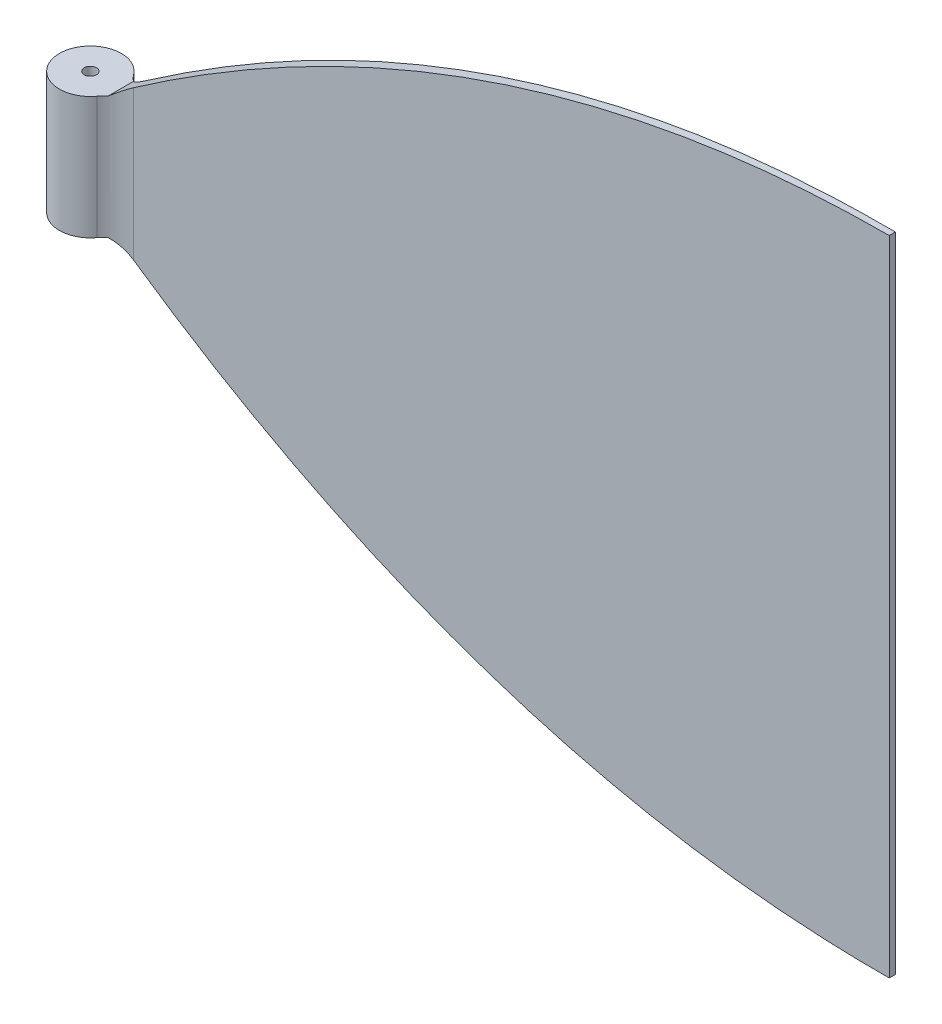
ISO-10303-21;
HEADER;
FILE_DESCRIPTION(('STEP AP214'),'2;1');
FILE_NAME('part.step','',(''),(''),'','','');
FILE_SCHEMA(('AUTOMOTIVE_DESIGN { 1 0 10303 214 1 1 1 1 }'));
ENDSEC;
DATA;
#1=APPLICATION_CONTEXT('core data for automotive mechanical design processes');
#2=APPLICATION_PROTOCOL_DEFINITION('international standard','automotive_design',2000,#1);
#3=PRODUCT_CONTEXT('',#1,'mechanical');
#4=PRODUCT('Part','Part','',(#3));
#5=PRODUCT_RELATED_PRODUCT_CATEGORY('part','',(#4));
#6=PRODUCT_DEFINITION_FORMATION('','',#4);
#7=PRODUCT_DEFINITION_CONTEXT('part definition',#1,'design');
#8=PRODUCT_DEFINITION('design','',#6,#7);
#9=PRODUCT_DEFINITION_SHAPE('','',#8);
#10=(LENGTH_UNIT() NAMED_UNIT(*) SI_UNIT(.MILLI.,.METRE.));
#11=(NAMED_UNIT(*) PLANE_ANGLE_UNIT() SI_UNIT($,.RADIAN.));
#12=(NAMED_UNIT(*) SI_UNIT($,.STERADIAN.) SOLID_ANGLE_UNIT());
#13=UNCERTAINTY_MEASURE_WITH_UNIT(LENGTH_MEASURE(1.E-05),#10,'distance_accuracy_value','');
#14=(GEOMETRIC_REPRESENTATION_CONTEXT(3) GLOBAL_UNCERTAINTY_ASSIGNED_CONTEXT((#13)) GLOBAL_UNIT_ASSIGNED_CONTEXT((#10,
#11,#12)) REPRESENTATION_CONTEXT('',''));
#15=CARTESIAN_POINT('',(0.,0.,0.));
#16=DIRECTION('',(0.,0.,1.));
#17=DIRECTION('',(1.,0.,0.));
#18=AXIS2_PLACEMENT_3D('',#15,#16,#17);
#19=CARTESIAN_POINT('',(20.,-20.,-2.));
#20=CARTESIAN_POINT('',(138.919313479711,-105.321902733238,-2.));
#21=CARTESIAN_POINT('',(272.,-105.,-2.));
#22=B_SPLINE_CURVE_WITH_KNOTS('',2,(#19,#20,#21),.UNSPECIFIED.,.F.,.F.,(3,3),(0.,1.),.UNSPECIFIED.);
#23=DIRECTION('',(0.,0.,1.));
#24=VECTOR('',#23,1.);
#25=SURFACE_OF_LINEAR_EXTRUSION('',#22,#24);
#26=CARTESIAN_POINT('',(20.,-20.,2.00000000000002));
#27=CARTESIAN_POINT('',(22.4840917394235,-21.7822817042543,1.99014249309755));
#28=CARTESIAN_POINT('',(24.9830550840403,-23.5438759232565,1.98022597188875));
#29=CARTESIAN_POINT('',(30.0110898033797,-27.0244079916901,1.96027345316121));
#30=CARTESIAN_POINT('',(32.540165853338,-28.7433390861028,1.95023743708995));
#31=CARTESIAN_POINT('',(37.6282045916227,-32.1368320692445,1.93004680717612));
#32=CARTESIAN_POINT('',(40.1871695616172,-33.8113905383259,1.91989218427932));
#33=CARTESIAN_POINT('',(45.3347317782487,-37.1144430421728,1.89946535008633));
#34=CARTESIAN_POINT('',(47.9233295656336,-38.7429362344383,1.88919313664433));
#35=CARTESIAN_POINT('',(53.132873743559,-41.9540319157157,1.86852034228748));
#36=CARTESIAN_POINT('',(55.7538533365913,-43.536580554936,1.85811962961672));
#37=CARTESIAN_POINT('',(61.0249507072113,-46.6521928924658,1.8372025765587));
#38=CARTESIAN_POINT('',(63.6750675007789,-48.1852582550821,1.82668624007629));
#39=CARTESIAN_POINT('',(69.0041301085415,-51.2002932356817,1.80553916623596));
#40=CARTESIAN_POINT('',(71.6830752015533,-52.6822641279887,1.79490843173988));
#41=CARTESIAN_POINT('',(77.0694673153968,-55.5935345762446,1.77353385985955));
#42=CARTESIAN_POINT('',(79.776914531805,-57.022833770466,1.7627900216992));
#43=CARTESIAN_POINT('',(85.1523498423434,-59.7923860491426,1.74145892919707));
#44=CARTESIAN_POINT('',(87.8196531674043,-61.1339680493266,1.73087439219286));
#45=CARTESIAN_POINT('',(93.180365639124,-63.7640304908602,1.70960172365428));
#46=CARTESIAN_POINT('',(95.8737751360258,-65.052510218563,1.69891359073007));
#47=CARTESIAN_POINT('',(101.28599336206,-67.5748766837543,1.67743653427755));
#48=CARTESIAN_POINT('',(104.00480169955,-68.8087642613579,1.66664761230339));
#49=CARTESIAN_POINT('',(109.467080521977,-71.220523753902,1.64497190269058));
#50=CARTESIAN_POINT('',(112.210550421359,-72.3983969946695,1.63408511737557));
#51=CARTESIAN_POINT('',(117.719592377962,-74.6960294324583,1.61222383977));
#52=CARTESIAN_POINT('',(120.485148596235,-75.8158265957937,1.60124941033241));
#53=CARTESIAN_POINT('',(126.039310746096,-77.9968495642129,1.5792090843409));
#54=CARTESIAN_POINT('',(128.827917003399,-79.0580745399943,1.56814318649446));
#55=CARTESIAN_POINT('',(134.427353080317,-81.1207585702926,1.54592320206224));
#56=CARTESIAN_POINT('',(137.238184255185,-82.1222139477911,1.53476911009848));
#57=CARTESIAN_POINT('',(142.881178728946,-84.0642378179407,1.51237627488515));
#58=CARTESIAN_POINT('',(145.713344664912,-85.0047986411784,1.501137521171));
#59=CARTESIAN_POINT('',(152.523376814176,-87.1840916908317,1.47411358407074));
#60=CARTESIAN_POINT('',(156.510714074172,-88.3933651845871,1.45829081716599));
#61=CARTESIAN_POINT('',(164.52168154872,-90.6884768552013,1.42650126369557));
#62=CARTESIAN_POINT('',(168.545319590741,-91.7742876885075,1.4105344460685));
#63=CARTESIAN_POINT('',(176.625097156821,-93.8201246425597,1.37847183667929));
#64=CARTESIAN_POINT('',(180.681241360058,-94.7801322961653,1.36237602634898));
#65=CARTESIAN_POINT('',(188.822055654753,-96.5725007020712,1.33007120771924));
#66=CARTESIAN_POINT('',(192.906728501778,-97.4048489404308,1.31386218848502));
#67=CARTESIAN_POINT('',(201.100516881526,-98.9405610427066,1.28134715523205));
#68=CARTESIAN_POINT('',(205.209633927333,-99.6439168344482,1.265041135209));
#69=CARTESIAN_POINT('',(213.473887192966,-100.924825848285,1.232246479393));
#70=CARTESIAN_POINT('',(217.629150316054,-101.501560329249,1.21575734001566));
#71=CARTESIAN_POINT('',(225.955745987177,-102.523308858641,1.18271529370168));
#72=CARTESIAN_POINT('',(230.127078182515,-102.968325781605,1.16616238816463));
#73=CARTESIAN_POINT('',(238.481495967765,-103.726918160202,1.13300993663586));
#74=CARTESIAN_POINT('',(242.664581126123,-104.040498380136,1.11641039235666));
#75=CARTESIAN_POINT('',(251.038264922085,-104.537015212657,1.08318148840443));
#76=CARTESIAN_POINT('',(255.228863017758,-104.71996089599,1.06655213088191));
#77=CARTESIAN_POINT('',(261.517067108543,-104.897383942328,1.04159894004547));
#78=CARTESIAN_POINT('',(263.613412359526,-104.940359326581,1.03328010968442));
#79=CARTESIAN_POINT('',(267.806507504731,-104.994204359294,1.0166408432352));
#80=CARTESIAN_POINT('',(269.903257397338,-105.005074133316,1.00832040715342));
#81=CARTESIAN_POINT('',(272.,-105.,1.));
#82=B_SPLINE_CURVE_WITH_KNOTS('',3,(#26,#27,#28,#29,#30,#31,#32,#33,#34,#35,#36,#37,#38,#39,#40,
#41,#42,#43,#44,#45,#46,#47,#48,#49,#50,#51,#52,#53,#54,#55,#56,#57,#58,#59,#60,#61,#62,#63,#64,
#65,#66,#67,#68,#69,#70,#71,#72,#73,#74,#75,#76,#77,#78,#79,#80,#81),.UNSPECIFIED.,.F.,.F.,(4,2,
2,2,2,2,2,2,2,2,2,2,2,2,2,2,2,2,2,2,2,2,2,2,2,2,2,4),(0.,9.17195315115567,18.3453493868253,
27.5194505409021,36.6937193741963,45.8783391907578,55.0626497717837,64.2467311252011,
73.4308755393231,82.3874307962042,91.3441063818957,100.300644085884,109.256969688171,
118.207364458817,127.15788592239,136.108957454602,145.061154152397,157.559214559814,
170.060037571432,182.562693577005,195.066574385586,207.5712374035,220.154519027905,
232.737526020955,245.320076867214,257.901753945864,264.191949130425,270.482119714757),.UNSPECIFIED.);
#83=CARTESIAN_POINT('',(26.2034924464706,-24.3858896632219,1.97538296648228));
#84=VERTEX_POINT('',#83);
#85=CARTESIAN_POINT('',(272.,-104.999999999995,1.));
#86=VERTEX_POINT('',#85);
#87=EDGE_CURVE('E104',#84,#86,#82,.T.);
#88=ORIENTED_EDGE('',*,*,#87,.F.);
#89=CARTESIAN_POINT('',(26.2034924464706,-24.3858896632219,1.97538296648228));
#90=CARTESIAN_POINT('',(25.9680726874608,-24.2219065924239,1.97632213343175));
#91=CARTESIAN_POINT('',(25.7328065138624,-24.0577489031849,1.98556460874679));
#92=CARTESIAN_POINT('',(25.2631877946614,-23.7295174487943,2.02065010869406));
#93=CARTESIAN_POINT('',(25.0288360858931,-23.5654438439729,2.04650583026977));
#94=CARTESIAN_POINT('',(24.5619451445727,-23.23801708712,2.1148205531653));
#95=CARTESIAN_POINT('',(24.3294064791083,-23.0746641669357,2.15728455227614));
#96=CARTESIAN_POINT('',(23.8729080525505,-22.7534544831751,2.25753415116885));
#97=CARTESIAN_POINT('',(23.6488805419202,-22.5955636185591,2.31490248563529));
#98=CARTESIAN_POINT('',(23.2042161380717,-22.2816747177374,2.44543593377505));
#99=CARTESIAN_POINT('',(22.9835781692637,-22.125676084528,2.51859592059892));
#100=CARTESIAN_POINT('',(22.5465684871054,-21.8162163261769,2.6807127461819));
#101=CARTESIAN_POINT('',(22.3301950685577,-21.6627541909371,2.76966312262764));
#102=CARTESIAN_POINT('',(21.7479312497994,-21.249159376738,3.03348242191092));
#103=CARTESIAN_POINT('',(21.3868089871166,-20.9919567067779,3.22403507100303));
#104=CARTESIAN_POINT('',(20.9170007295102,-20.6565276948687,3.51059803535319));
#105=CARTESIAN_POINT('',(20.7993776117586,-20.5724764344721,3.58574552712704));
#106=CARTESIAN_POINT('',(20.5665648402957,-20.4059767560635,3.74148931825468));
#107=CARTESIAN_POINT('',(20.4513755857125,-20.3235286011184,3.82208650233733));
#108=CARTESIAN_POINT('',(20.2236353479029,-20.1603906126406,3.98874857819564));
#109=CARTESIAN_POINT('',(20.111085573615,-20.0797015859728,4.07481591095164));
#110=CARTESIAN_POINT('',(19.9999999999997,-20.,4.16359699285298));
#111=B_SPLINE_CURVE_WITH_KNOTS('',3,(#89,#90,#91,#92,#93,#94,#95,#96,#97,#98,#99,#100,#101,#102,
#103,#104,#105,#106,#107,#108,#109,#110),.UNSPECIFIED.,.F.,.F.,(4,2,2,2,2,2,2,2,2,2,4),(0.,
0.86059272449847,1.72184395456842,2.58335455346916,3.42294825542364,4.26226978740637,
5.10124861052295,6.54559605853971,7.03432325389394,7.52312998292169,8.01215638802802),.UNSPECIFIED.);
#112=CARTESIAN_POINT('',(20.0000000000051,-20.0000000000051,4.16359699284477));
#113=VERTEX_POINT('',#112);
#114=EDGE_CURVE('E251',#84,#113,#111,.T.);
#115=ORIENTED_EDGE('',*,*,#114,.T.);
#116=DIRECTION('',(0.,0.,1.));
#117=VECTOR('',#116,1.);
#118=CARTESIAN_POINT('',(20.0000000000051,-20.0000000000051,-2.));
#119=LINE('',#118,#117);
#120=CARTESIAN_POINT('',(20.0000000000051,-20.0000000000051,-4.16359699284477));
#121=VERTEX_POINT('',#120);
#122=EDGE_CURVE('E62',#121,#113,#119,.T.);
#123=ORIENTED_EDGE('',*,*,#122,.F.);
#124=CARTESIAN_POINT('',(19.9999999999972,-20.,-4.16359699284477));
#125=CARTESIAN_POINT('',(20.1966397249543,-20.1410859595347,-4.00644832270012));
#126=CARTESIAN_POINT('',(20.397816525963,-20.2852279289383,-3.85782482244283));
#127=CARTESIAN_POINT('',(20.8079084924652,-20.5786216397087,-3.5777143183741));
#128=CARTESIAN_POINT('',(21.0168173829495,-20.7278692304481,-3.44621379366347));
#129=CARTESIAN_POINT('',(21.441327509222,-21.0306800905642,-3.20020109207444));
#130=CARTESIAN_POINT('',(21.6569279089178,-21.1842428205469,-3.0856868030469));
#131=CARTESIAN_POINT('',(22.0884528487226,-21.4911147792713,-2.87616119377476));
#132=CARTESIAN_POINT('',(22.3042404418262,-21.6443383155858,-2.78074130981118));
#133=CARTESIAN_POINT('',(22.7403319407496,-21.9535052279392,-2.60592480377627));
#134=CARTESIAN_POINT('',(22.9606360798264,-22.109448744389,-2.52652901157689));
#135=CARTESIAN_POINT('',(23.4048089231615,-22.4233557142377,-2.38373990760756));
#136=CARTESIAN_POINT('',(23.6286765973401,-22.5813185814114,-2.32034205764758));
#137=CARTESIAN_POINT('',(24.2369794083476,-23.0098429170653,-2.17068054927307));
#138=CARTESIAN_POINT('',(24.6242104612275,-23.2818882543337,-2.09943529987035));
#139=CARTESIAN_POINT('',(25.2110145078617,-23.6929796449826,-2.02672256657956));
#140=CARTESIAN_POINT('',(25.4090275741985,-23.8315023963205,-2.00817063531258));
#141=CARTESIAN_POINT('',(25.8058069324445,-24.108677844965,-1.98289750413789));
#142=CARTESIAN_POINT('',(26.0045734354757,-24.2473305690054,-1.97617991074043));
#143=CARTESIAN_POINT('',(26.2034924464683,-24.3858896632204,-1.97538296648229));
#144=B_SPLINE_CURVE_WITH_KNOTS('',3,(#124,#125,#126,#127,#128,#129,#130,#131,#132,#133,#134,
#135,#136,#137,#138,#139,#140,#141,#142,#143),.UNSPECIFIED.,.F.,.F.,(4,2,2,2,2,2,2,2,2,4),(0.,
0.865426233259687,1.73016489723642,2.59479594520512,3.43827600044183,4.28179972747891,
5.1250838996277,6.55814872548987,7.28501364523995,8.01210003852141),.UNSPECIFIED.);
#145=CARTESIAN_POINT('',(26.2034924464637,-24.3858896632171,-1.97538296648231));
#146=VERTEX_POINT('',#145);
#147=EDGE_CURVE('E146',#121,#146,#144,.T.);
#148=ORIENTED_EDGE('',*,*,#147,.T.);
#149=CARTESIAN_POINT('',(272.,-105.,-1.));
#150=CARTESIAN_POINT('',(268.931235949801,-105.007446107981,-1.01217763511984));
#151=CARTESIAN_POINT('',(265.862373083851,-104.980705614315,-1.02435566236567));
#152=CARTESIAN_POINT('',(259.725831898135,-104.858242046089,-1.04870701627724));
#153=CARTESIAN_POINT('',(256.658153665731,-104.762514601326,-1.06088034259631));
#154=CARTESIAN_POINT('',(250.525664311012,-104.501462873907,-1.08521561781344));
#155=CARTESIAN_POINT('',(247.460853274353,-104.336136574624,-1.09737756637162));
#156=CARTESIAN_POINT('',(241.335786252268,-103.935451388302,-1.12168338788783));
#157=CARTESIAN_POINT('',(238.275530301134,-103.700091976687,-1.13382726070979));
#158=CARTESIAN_POINT('',(232.166983922836,-103.159549378771,-1.15806752411573));
#159=CARTESIAN_POINT('',(229.118681817109,-102.854498223663,-1.17016396104322));
#160=CARTESIAN_POINT('',(223.029977625682,-102.174185110302,-1.19432548561238));
#161=CARTESIAN_POINT('',(219.989575393245,-101.798924465749,-1.20639057383633));
#162=CARTESIAN_POINT('',(213.918325171769,-100.978197605586,-1.23048283661997));
#163=CARTESIAN_POINT('',(210.887476987681,-100.532732832808,-1.24251001195365));
#164=CARTESIAN_POINT('',(204.836960497794,-99.5717511057921,-1.26651999802463));
#165=CARTESIAN_POINT('',(201.817291978713,-99.0562354951093,-1.27850280960829));
#166=CARTESIAN_POINT('',(196.041291802082,-98.0012222322678,-1.30142344522984));
#167=CARTESIAN_POINT('',(193.28394312102,-97.4672836946353,-1.31236530507532));
#168=CARTESIAN_POINT('',(187.781191801475,-96.34111772279,-1.33420161983542));
#169=CARTESIAN_POINT('',(185.03578907731,-95.748890707367,-1.34509607509005));
#170=CARTESIAN_POINT('',(179.558130146,-94.5065951491218,-1.36683281688096));
#171=CARTESIAN_POINT('',(176.825873820995,-93.8565271258732,-1.37767510388495));
#172=CARTESIAN_POINT('',(171.375677935223,-92.4990986922324,-1.39930286533642));
#173=CARTESIAN_POINT('',(168.657738148727,-91.7917391880557,-1.41008834067966));
#174=CARTESIAN_POINT('',(163.234625002847,-90.3196456650985,-1.43160863094109));
#175=CARTESIAN_POINT('',(160.529466505274,-89.5548569038141,-1.44234338688384));
#176=CARTESIAN_POINT('',(155.135617784451,-87.9692315772973,-1.46374754847441));
#177=CARTESIAN_POINT('',(152.446927628317,-87.1483947838099,-1.47441695385589));
#178=CARTESIAN_POINT('',(147.086958263448,-85.4514624703896,-1.49568667355776));
#179=CARTESIAN_POINT('',(144.415679551133,-84.5753653824599,-1.50628698590821));
#180=CARTESIAN_POINT('',(139.091467326254,-82.7687911313353,-1.52741481219741));
#181=CARTESIAN_POINT('',(136.438534579062,-81.8383117145003,-1.53794232309897));
#182=CARTESIAN_POINT('',(130.416111562431,-79.6574744420384,-1.56184082713322));
#183=CARTESIAN_POINT('',(127.05274140094,-78.3901780899022,-1.57518753412327));
#184=CARTESIAN_POINT('',(120.358821465799,-75.7702733108766,-1.60175070846906));
#185=CARTESIAN_POINT('',(117.02827691668,-74.417651549243,-1.61496715509255));
#186=CARTESIAN_POINT('',(110.401359679258,-71.6292697826058,-1.64126444571724));
#187=CARTESIAN_POINT('',(107.104994304342,-70.1934924004615,-1.65434526069707));
#188=CARTESIAN_POINT('',(100.547751586232,-67.2411307103939,-1.68036606513401));
#189=CARTESIAN_POINT('',(97.2868826216077,-65.7245278019953,-1.69330602134284));
#190=CARTESIAN_POINT('',(90.8018766982225,-62.6129843873676,-1.71904017183247));
#191=CARTESIAN_POINT('',(87.5777479062818,-61.0180268669178,-1.73183433370525));
#192=CARTESIAN_POINT('',(81.1674083580061,-57.7523779388562,-1.75727218905555));
#193=CARTESIAN_POINT('',(77.9812040776239,-56.0816738245774,-1.76991585683484));
#194=CARTESIAN_POINT('',(71.6461757755992,-52.666363936241,-1.79505485803335));
#195=CARTESIAN_POINT('',(68.4973755856208,-50.9217139753943,-1.80755009688247));
#196=CARTESIAN_POINT('',(62.2399462709242,-47.3621935397981,-1.83238116559159));
#197=CARTESIAN_POINT('',(59.1313151203982,-45.5473266248179,-1.8447170034905));
#198=CARTESIAN_POINT('',(52.9551954416338,-41.850310870755,-1.86922541491417));
#199=CARTESIAN_POINT('',(49.8876986996973,-39.9681757473794,-1.88139802103297));
#200=CARTESIAN_POINT('',(43.7947578613292,-36.1396562838151,-1.90557635769316));
#201=CARTESIAN_POINT('',(40.769297747725,-34.1932974249999,-1.91758215179476));
#202=CARTESIAN_POINT('',(34.7612932014774,-30.2394556779567,-1.9414234396767));
#203=CARTESIAN_POINT('',(31.7787233506965,-28.2320113916595,-1.95325903432265));
#204=CARTESIAN_POINT('',(25.8572806068838,-24.1591921833405,-1.97675682298858));
#205=CARTESIAN_POINT('',(22.918371386012,-22.0938700894981,-1.98841916116664));
#206=CARTESIAN_POINT('',(20.,-20.,-2.00000000000001));
#207=B_SPLINE_CURVE_WITH_KNOTS('',3,(#149,#150,#151,#152,#153,#154,#155,#156,#157,#158,#159,
#160,#161,#162,#163,#164,#165,#166,#167,#168,#169,#170,#171,#172,#173,#174,#175,#176,#177,#178,
#179,#180,#181,#182,#183,#184,#185,#186,#187,#188,#189,#190,#191,#192,#193,#194,#195,#196,#197,
#198,#199,#200,#201,#202,#203,#204,#205,#206),.UNSPECIFIED.,.F.,.F.,(4,2,2,2,2,2,2,2,2,2,2,2,2,
2,2,2,2,2,2,2,2,2,2,2,2,2,2,2,4),(0.,9.20622496847426,18.4130331867449,27.6201081909254,
36.8272521617148,46.0170957331871,55.2067673694582,64.3962501647494,73.5855567332208,
82.0107077344903,90.4357982073082,98.8608130069404,107.285694568834,115.718711377322,
124.15176253124,132.585053078572,141.018693355249,151.800148541477,162.5832928593,
173.368698733067,184.156597474214,194.946849185499,205.738917732859,216.537528665042,
227.335592858595,238.131467793486,248.923109683609,259.70806808442,270.483484027226),.UNSPECIFIED.);
#208=CARTESIAN_POINT('',(272.,-104.999999999995,-1.));
#209=VERTEX_POINT('',#208);
#210=EDGE_CURVE('E129',#209,#146,#207,.T.);
#211=ORIENTED_EDGE('',*,*,#210,.F.);
#212=DIRECTION('',(0.,0.,1.));
#213=VECTOR('',#212,1.);
#214=CARTESIAN_POINT('',(271.999999999996,-104.999999999995,-2.));
#215=LINE('',#214,#213);
#216=EDGE_CURVE('E122',#209,#86,#215,.T.);
#217=ORIENTED_EDGE('',*,*,#216,.T.);
#218=EDGE_LOOP('',(#88,#115,#123,#148,#211,#217));
#219=FACE_BOUND('',#218,.T.);
#220=ADVANCED_FACE('F35',(#219),#25,.T.);
#221=CARTESIAN_POINT('',(272.,105.,-2.));
#222=CARTESIAN_POINT('',(138.919313479709,105.321902733239,-2.));
#223=CARTESIAN_POINT('',(20.,20.,-2.));
#224=B_SPLINE_CURVE_WITH_KNOTS('',2,(#221,#222,#223),.UNSPECIFIED.,.F.,.F.,(3,3),(0.,1.),.UNSPECIFIED.);
#225=DIRECTION('',(0.,0.,1.));
#226=VECTOR('',#225,1.);
#227=SURFACE_OF_LINEAR_EXTRUSION('',#224,#226);
#228=CARTESIAN_POINT('',(272.,105.,1.));
#229=CARTESIAN_POINT('',(268.931235949801,105.007446107981,1.01217763511984));
#230=CARTESIAN_POINT('',(265.862373083851,104.980705614315,1.02435566236567));
#231=CARTESIAN_POINT('',(259.725831898135,104.858242046089,1.04870701627724));
#232=CARTESIAN_POINT('',(256.658153665731,104.762514601326,1.06088034259631));
#233=CARTESIAN_POINT('',(250.525664311012,104.501462873907,1.08521561781344));
#234=CARTESIAN_POINT('',(247.460853274354,104.336136574624,1.09737756637161));
#235=CARTESIAN_POINT('',(241.335786252268,103.935451388302,1.12168338788783));
#236=CARTESIAN_POINT('',(238.275530301134,103.700091976687,1.13382726070979));
#237=CARTESIAN_POINT('',(232.166983922836,103.159549378771,1.15806752411573));
#238=CARTESIAN_POINT('',(229.11868181711,102.854498223663,1.17016396104322));
#239=CARTESIAN_POINT('',(223.029977625683,102.174185110302,1.19432548561237));
#240=CARTESIAN_POINT('',(219.989575393246,101.798924465749,1.20639057383633));
#241=CARTESIAN_POINT('',(213.918325171769,100.978197605587,1.23048283661997));
#242=CARTESIAN_POINT('',(210.887476987681,100.532732832809,1.24251001195365));
#243=CARTESIAN_POINT('',(204.836960497794,99.5717511057927,1.26651999802463));
#244=CARTESIAN_POINT('',(201.817291978713,99.0562354951099,1.27850280960829));
#245=CARTESIAN_POINT('',(196.041291802083,98.0012222322684,1.30142344522984));
#246=CARTESIAN_POINT('',(193.283943121021,97.4672836946361,1.31236530507532));
#247=CARTESIAN_POINT('',(187.781191801476,96.3411177227908,1.33420161983542));
#248=CARTESIAN_POINT('',(185.035789077311,95.7488907073679,1.34509607509004));
#249=CARTESIAN_POINT('',(179.558130146001,94.5065951491228,1.36683281688096));
#250=CARTESIAN_POINT('',(176.825873820996,93.8565271258742,1.37767510388494));
#251=CARTESIAN_POINT('',(171.375677935224,92.4990986922335,1.39930286533642));
#252=CARTESIAN_POINT('',(168.657738148728,91.7917391880568,1.41008834067966));
#253=CARTESIAN_POINT('',(163.234625002848,90.3196456650998,1.43160863094109));
#254=CARTESIAN_POINT('',(160.529466505275,89.5548569038154,1.44234338688384));
#255=CARTESIAN_POINT('',(155.135617784453,87.9692315772987,1.4637475484744));
#256=CARTESIAN_POINT('',(152.446927628319,87.1483947838113,1.47441695385589));
#257=CARTESIAN_POINT('',(147.08695826345,85.4514624703911,1.49568667355775));
#258=CARTESIAN_POINT('',(144.415679551135,84.5753653824615,1.50628698590821));
#259=CARTESIAN_POINT('',(139.091467326257,82.768791131337,1.52741481219741));
#260=CARTESIAN_POINT('',(136.438534579064,81.838311714502,1.53794232309896));
#261=CARTESIAN_POINT('',(130.416111562434,79.6574744420403,1.56184082713321));
#262=CARTESIAN_POINT('',(127.052741400942,78.3901780899039,1.57518753412326));
#263=CARTESIAN_POINT('',(120.358821465802,75.7702733108784,1.60175070846905));
#264=CARTESIAN_POINT('',(117.028276916682,74.4176515492448,1.61496715509254));
#265=CARTESIAN_POINT('',(110.40135967926,71.6292697826076,1.64126444571724));
#266=CARTESIAN_POINT('',(107.104994304344,70.1934924004632,1.65434526069706));
#267=CARTESIAN_POINT('',(100.547751586234,67.2411307103956,1.68036606513401));
#268=CARTESIAN_POINT('',(97.2868826216094,65.724527801997,1.69330602134283));
#269=CARTESIAN_POINT('',(90.8018766982239,62.6129843873692,1.71904017183246));
#270=CARTESIAN_POINT('',(87.5777479062832,61.0180268669193,1.73183433370524));
#271=CARTESIAN_POINT('',(81.1674083580074,57.7523779388577,1.75727218905554));
#272=CARTESIAN_POINT('',(77.9812040776251,56.0816738245788,1.76991585683484));
#273=CARTESIAN_POINT('',(71.6461757756003,52.6663639362424,1.79505485803335));
#274=CARTESIAN_POINT('',(68.4973755856218,50.9217139753955,1.80755009688247));
#275=CARTESIAN_POINT('',(62.239946270925,47.3621935397992,1.83238116559158));
#276=CARTESIAN_POINT('',(59.131315120399,45.547326624819,1.8447170034905));
#277=CARTESIAN_POINT('',(52.9551954416344,41.8503108707559,1.86922541491417));
#278=CARTESIAN_POINT('',(49.8876986996979,39.9681757473802,1.88139802103296));
#279=CARTESIAN_POINT('',(43.7947578613297,36.1396562838158,1.90557635769315));
#280=CARTESIAN_POINT('',(40.7692977477254,34.1932974250005,1.91758215179476));
#281=CARTESIAN_POINT('',(34.7612932014776,30.2394556779571,1.9414234396767));
#282=CARTESIAN_POINT('',(31.7787233506968,28.2320113916598,1.95325903432265));
#283=CARTESIAN_POINT('',(25.8572806068839,24.1591921833407,1.97675682298857));
#284=CARTESIAN_POINT('',(22.918371386012,22.0938700894981,1.98841916116664));
#285=CARTESIAN_POINT('',(20.,20.,2.00000000000001));
#286=B_SPLINE_CURVE_WITH_KNOTS('',3,(#228,#229,#230,#231,#232,#233,#234,#235,#236,#237,#238,
#239,#240,#241,#242,#243,#244,#245,#246,#247,#248,#249,#250,#251,#252,#253,#254,#255,#256,#257,
#258,#259,#260,#261,#262,#263,#264,#265,#266,#267,#268,#269,#270,#271,#272,#273,#274,#275,#276,
#277,#278,#279,#280,#281,#282,#283,#284,#285),.UNSPECIFIED.,.F.,.F.,(4,2,2,2,2,2,2,2,2,2,2,2,2,
2,2,2,2,2,2,2,2,2,2,2,2,2,2,2,4),(0.,9.2062249684742,18.4130331867447,27.6201081909252,
36.8272521617145,46.0170957331867,55.2067673694577,64.3962501647488,73.5855567332202,
82.0107077344894,90.435798207307,98.8608130069389,107.285694568832,115.71871137732,
124.151762531238,132.585053078569,141.018693355246,151.800148541475,162.583292859298,
173.368698733065,184.156597474212,194.946849185498,205.738917732857,216.537528665041,
227.335592858594,238.131467793485,248.923109683608,259.70806808442,270.483484027226),.UNSPECIFIED.);
#287=CARTESIAN_POINT('',(272.,105.,1.));
#288=VERTEX_POINT('',#287);
#289=CARTESIAN_POINT('',(26.2034924464637,24.3858896632173,1.97538296648231));
#290=VERTEX_POINT('',#289);
#291=EDGE_CURVE('E115',#288,#290,#286,.T.);
#292=ORIENTED_EDGE('',*,*,#291,.F.);
#293=DIRECTION('',(0.,0.,1.));
#294=VECTOR('',#293,1.);
#295=CARTESIAN_POINT('',(272.,105.,-2.));
#296=LINE('',#295,#294);
#297=CARTESIAN_POINT('',(272.,105.,-1.));
#298=VERTEX_POINT('',#297);
#299=EDGE_CURVE('E124',#298,#288,#296,.T.);
#300=ORIENTED_EDGE('',*,*,#299,.F.);
#301=CARTESIAN_POINT('',(20.,20.,-2.00000000000002));
#302=CARTESIAN_POINT('',(22.4840917394235,21.7822817042543,-1.99014249309755));
#303=CARTESIAN_POINT('',(24.9830550840402,23.5438759232565,-1.98022597188875));
#304=CARTESIAN_POINT('',(30.0110898033795,27.0244079916902,-1.96027345316121));
#305=CARTESIAN_POINT('',(32.5401658533378,28.7433390861029,-1.95023743708995));
#306=CARTESIAN_POINT('',(37.6282045916224,32.1368320692446,-1.93004680717612));
#307=CARTESIAN_POINT('',(40.1871695616168,33.811390538326,-1.91989218427932));
#308=CARTESIAN_POINT('',(45.3347317782483,37.114443042173,-1.89946535008633));
#309=CARTESIAN_POINT('',(47.9233295656331,38.7429362344384,-1.88919313664433));
#310=CARTESIAN_POINT('',(53.1328737435585,41.9540319157159,-1.86852034228748));
#311=CARTESIAN_POINT('',(55.7538533365907,43.5365805549362,-1.85811962961672));
#312=CARTESIAN_POINT('',(61.0249507072106,46.6521928924661,-1.8372025765587));
#313=CARTESIAN_POINT('',(63.6750675007782,48.1852582550824,-1.82668624007629));
#314=CARTESIAN_POINT('',(69.0041301085407,51.200293235682,-1.80553916623597));
#315=CARTESIAN_POINT('',(71.6830752015525,52.682264127989,-1.79490843173989));
#316=CARTESIAN_POINT('',(77.0694673153959,55.5935345762448,-1.77353385985956));
#317=CARTESIAN_POINT('',(79.7769145318041,57.0228337704663,-1.76279002169921));
#318=CARTESIAN_POINT('',(85.1523498423423,59.7923860491428,-1.74145892919707));
#319=CARTESIAN_POINT('',(87.8196531674031,61.1339680493268,-1.73087439219286));
#320=CARTESIAN_POINT('',(93.1803656391225,63.7640304908603,-1.70960172365429));
#321=CARTESIAN_POINT('',(95.8737751360242,65.0525102185631,-1.69891359073008));
#322=CARTESIAN_POINT('',(101.285993362058,67.5748766837543,-1.67743653427756));
#323=CARTESIAN_POINT('',(104.004801699548,68.8087642613579,-1.66664761230339));
#324=CARTESIAN_POINT('',(109.467080521975,71.2205237539019,-1.64497190269059));
#325=CARTESIAN_POINT('',(112.210550421357,72.3983969946694,-1.63408511737558));
#326=CARTESIAN_POINT('',(117.71959237796,74.6960294324581,-1.61222383977001));
#327=CARTESIAN_POINT('',(120.485148596232,75.8158265957935,-1.60124941033242));
#328=CARTESIAN_POINT('',(126.039310746092,77.9968495642126,-1.57920908434091));
#329=CARTESIAN_POINT('',(128.827917003396,79.0580745399939,-1.56814318649447));
#330=CARTESIAN_POINT('',(134.427353080314,81.1207585702922,-1.54592320206226));
#331=CARTESIAN_POINT('',(137.238184255181,82.1222139477907,-1.5347691100985));
#332=CARTESIAN_POINT('',(142.881178728942,84.0642378179402,-1.51237627488516));
#333=CARTESIAN_POINT('',(145.713344664908,85.0047986411779,-1.50113752117101));
#334=CARTESIAN_POINT('',(152.523376814172,87.1840916908312,-1.47411358407076));
#335=CARTESIAN_POINT('',(156.510714074168,88.3933651845867,-1.45829081716601));
#336=CARTESIAN_POINT('',(164.521681548716,90.6884768552011,-1.42650126369558));
#337=CARTESIAN_POINT('',(168.545319590737,91.7742876885073,-1.41053444606851));
#338=CARTESIAN_POINT('',(176.625097156817,93.8201246425596,-1.3784718366793));
#339=CARTESIAN_POINT('',(180.681241360055,94.7801322961653,-1.362376026349));
#340=CARTESIAN_POINT('',(188.82205565475,96.5725007020713,-1.33007120771925));
#341=CARTESIAN_POINT('',(192.906728501775,97.4048489404308,-1.31386218848503));
#342=CARTESIAN_POINT('',(201.100516881523,98.9405610427067,-1.28134715523206));
#343=CARTESIAN_POINT('',(205.20963392733,99.6439168344483,-1.26504113520901));
#344=CARTESIAN_POINT('',(213.473887192964,100.924825848285,-1.23224647939301));
#345=CARTESIAN_POINT('',(217.629150316052,101.501560329249,-1.21575734001567));
#346=CARTESIAN_POINT('',(225.955745987175,102.523308858641,-1.18271529370169));
#347=CARTESIAN_POINT('',(230.127078182513,102.968325781605,-1.16616238816463));
#348=CARTESIAN_POINT('',(238.481495967764,103.726918160202,-1.13300993663586));
#349=CARTESIAN_POINT('',(242.664581126123,104.040498380136,-1.11641039235666));
#350=CARTESIAN_POINT('',(251.038264922084,104.537015212657,-1.08318148840443));
#351=CARTESIAN_POINT('',(255.228863017758,104.71996089599,-1.06655213088191));
#352=CARTESIAN_POINT('',(261.517067108543,104.897383942328,-1.04159894004547));
#353=CARTESIAN_POINT('',(263.613412359526,104.940359326581,-1.03328010968442));
#354=CARTESIAN_POINT('',(267.806507504731,104.994204359294,-1.0166408432352));
#355=CARTESIAN_POINT('',(269.903257397338,105.005074133316,-1.00832040715342));
#356=CARTESIAN_POINT('',(272.,105.,-1.));
#357=B_SPLINE_CURVE_WITH_KNOTS('',3,(#301,#302,#303,#304,#305,#306,#307,#308,#309,#310,#311,
#312,#313,#314,#315,#316,#317,#318,#319,#320,#321,#322,#323,#324,#325,#326,#327,#328,#329,#330,
#331,#332,#333,#334,#335,#336,#337,#338,#339,#340,#341,#342,#343,#344,#345,#346,#347,#348,#349,
#350,#351,#352,#353,#354,#355,#356),.UNSPECIFIED.,.F.,.F.,(4,2,2,2,2,2,2,2,2,2,2,2,2,2,2,2,2,2,
2,2,2,2,2,2,2,2,2,4),(0.,9.17195315115559,18.3453493868251,27.5194505409019,36.6937193741959,
45.8783391907574,55.0626497717832,64.2467311252005,73.4308755393225,82.3874307962032,
91.3441063818943,100.300644085882,109.256969688169,118.207364458815,127.157885922387,
136.108957454598,145.061154152393,157.55921455981,170.060037571429,182.562693577002,
195.066574385584,207.571237403498,220.154519027904,232.737526020954,245.320076867214,
257.901753945864,264.191949130425,270.482119714757),.UNSPECIFIED.);
#358=CARTESIAN_POINT('',(26.2034924464706,24.3858896632221,-1.97538296648228));
#359=VERTEX_POINT('',#358);
#360=EDGE_CURVE('E132',#359,#298,#357,.T.);
#361=ORIENTED_EDGE('',*,*,#360,.F.);
#362=CARTESIAN_POINT('',(26.2034924464706,24.3858896632221,-1.97538296648228));
#363=CARTESIAN_POINT('',(25.9680726874609,24.221906592424,-1.97632213343175));
#364=CARTESIAN_POINT('',(25.7328065138624,24.057748903185,-1.98556460874679));
#365=CARTESIAN_POINT('',(25.2631877946614,23.7295174487944,-2.02065010869406));
#366=CARTESIAN_POINT('',(25.0288360858931,23.565443843973,-2.04650583026977));
#367=CARTESIAN_POINT('',(24.5619451445727,23.2380170871201,-2.11482055316529));
#368=CARTESIAN_POINT('',(24.3294064791083,23.0746641669358,-2.15728455227614));
#369=CARTESIAN_POINT('',(23.8729080525505,22.7534544831752,-2.25753415116884));
#370=CARTESIAN_POINT('',(23.6488805419202,22.5955636185592,-2.31490248563528));
#371=CARTESIAN_POINT('',(23.2042161380718,22.2816747177375,-2.44543593377503));
#372=CARTESIAN_POINT('',(22.9835781692638,22.1256760845281,-2.5185959205989));
#373=CARTESIAN_POINT('',(22.5465684871055,21.816216326177,-2.68071274618189));
#374=CARTESIAN_POINT('',(22.3301950685578,21.6627541909372,-2.76966312262763));
#375=CARTESIAN_POINT('',(21.7479312497995,21.2491593767381,-3.03348242191091));
#376=CARTESIAN_POINT('',(21.3868089871167,20.9919567067779,-3.22403507100301));
#377=CARTESIAN_POINT('',(20.9170007295102,20.6565276948688,-3.51059803535317));
#378=CARTESIAN_POINT('',(20.7993776117586,20.5724764344721,-3.58574552712702));
#379=CARTESIAN_POINT('',(20.5665648402958,20.4059767560636,-3.74148931825467));
#380=CARTESIAN_POINT('',(20.4513755857125,20.3235286011184,-3.82208650233732));
#381=CARTESIAN_POINT('',(20.2236353479029,20.1603906126406,-3.98874857819564));
#382=CARTESIAN_POINT('',(20.111085573615,20.0797015859727,-4.07481591095164));
#383=CARTESIAN_POINT('',(19.9999999999997,20.,-4.16359699285298));
#384=B_SPLINE_CURVE_WITH_KNOTS('',3,(#362,#363,#364,#365,#366,#367,#368,#369,#370,#371,#372,
#373,#374,#375,#376,#377,#378,#379,#380,#381,#382,#383),.UNSPECIFIED.,.F.,.F.,(4,2,2,2,2,2,2,2,
2,2,4),(0.,0.860592724498471,1.72184395456842,2.58335455346916,3.42294825542363,
4.26226978740635,5.10124861052294,6.54559605853974,7.03432325389398,7.52312998292175,
8.0121563880281),.UNSPECIFIED.);
#385=CARTESIAN_POINT('',(20.0000000000051,20.0000000000051,-4.16359699284478));
#386=VERTEX_POINT('',#385);
#387=EDGE_CURVE('E152',#359,#386,#384,.T.);
#388=ORIENTED_EDGE('',*,*,#387,.T.);
#389=DIRECTION('',(0.,0.,1.));
#390=VECTOR('',#389,1.);
#391=CARTESIAN_POINT('',(20.0000000000051,20.0000000000051,-2.));
#392=LINE('',#391,#390);
#393=CARTESIAN_POINT('',(20.0000000000051,20.0000000000051,4.16359699284478));
#394=VERTEX_POINT('',#393);
#395=EDGE_CURVE('E54',#386,#394,#392,.T.);
#396=ORIENTED_EDGE('',*,*,#395,.T.);
#397=CARTESIAN_POINT('',(19.9999999999972,20.,4.16359699284478));
#398=CARTESIAN_POINT('',(20.1966397249543,20.1410859595347,4.00644832270013));
#399=CARTESIAN_POINT('',(20.397816525963,20.2852279289383,3.85782482244283));
#400=CARTESIAN_POINT('',(20.8079084924652,20.5786216397087,3.5777143183741));
#401=CARTESIAN_POINT('',(21.0168173829495,20.7278692304481,3.44621379366348));
#402=CARTESIAN_POINT('',(21.441327509222,21.0306800905642,3.20020109207445));
#403=CARTESIAN_POINT('',(21.6569279089178,21.1842428205469,3.08568680304691));
#404=CARTESIAN_POINT('',(22.0884528487226,21.4911147792713,2.87616119377477));
#405=CARTESIAN_POINT('',(22.3042404418262,21.6443383155858,2.7807413098112));
#406=CARTESIAN_POINT('',(22.7403319407496,21.9535052279392,2.60592480377628));
#407=CARTESIAN_POINT('',(22.9606360798263,22.109448744389,2.5265290115769));
#408=CARTESIAN_POINT('',(23.4048089231614,22.4233557142377,2.38373990760757));
#409=CARTESIAN_POINT('',(23.62867659734,22.5813185814115,2.32034205764759));
#410=CARTESIAN_POINT('',(24.2369794083476,23.0098429170654,2.17068054927308));
#411=CARTESIAN_POINT('',(24.6242104612275,23.2818882543337,2.09943529987035));
#412=CARTESIAN_POINT('',(25.2110145078617,23.6929796449827,2.02672256657957));
#413=CARTESIAN_POINT('',(25.4090275741984,23.8315023963205,2.00817063531258));
#414=CARTESIAN_POINT('',(25.8058069324445,24.1086778449651,1.98289750413789));
#415=CARTESIAN_POINT('',(26.0045734354757,24.2473305690055,1.97617991074043));
#416=CARTESIAN_POINT('',(26.2034924464683,24.3858896632205,1.97538296648229));
#417=B_SPLINE_CURVE_WITH_KNOTS('',3,(#397,#398,#399,#400,#401,#402,#403,#404,#405,#406,#407,
#408,#409,#410,#411,#412,#413,#414,#415,#416),.UNSPECIFIED.,.F.,.F.,(4,2,2,2,2,2,2,2,2,4),(0.,
0.865426233259688,1.73016489723641,2.59479594520512,3.43827600044182,4.2817997274789,
5.12508389962769,6.55814872548989,7.28501364524,8.01210003852147),.UNSPECIFIED.);
#418=EDGE_CURVE('E11',#394,#290,#417,.T.);
#419=ORIENTED_EDGE('',*,*,#418,.T.);
#420=EDGE_LOOP('',(#292,#300,#361,#388,#396,#419));
#421=FACE_BOUND('',#420,.T.);
#422=ADVANCED_FACE('F163',(#421),#227,.T.);
#423=CARTESIAN_POINT('',(271.999999999996,-104.999999999995,-2.));
#424=DIRECTION('',(1.,0.,0.));
#425=DIRECTION('',(0.,0.,-1.));
#426=AXIS2_PLACEMENT_3D('',#423,#424,#425);
#427=PLANE('',#426);
#428=DIRECTION('',(0.,1.,0.));
#429=VECTOR('',#428,1.);
#430=CARTESIAN_POINT('',(272.,-105.160951366619,1.));
#431=LINE('',#430,#429);
#432=EDGE_CURVE('E108',#86,#288,#431,.T.);
#433=ORIENTED_EDGE('',*,*,#432,.F.);
#434=ORIENTED_EDGE('',*,*,#216,.F.);
#435=DIRECTION('',(0.,1.,0.));
#436=VECTOR('',#435,1.);
#437=CARTESIAN_POINT('',(272.,-105.160951366619,-1.));
#438=LINE('',#437,#436);
#439=EDGE_CURVE('E114',#209,#298,#438,.T.);
#440=ORIENTED_EDGE('',*,*,#439,.T.);
#441=ORIENTED_EDGE('',*,*,#299,.T.);
#442=EDGE_LOOP('',(#433,#434,#440,#441));
#443=FACE_BOUND('',#442,.T.);
#444=ADVANCED_FACE('F120',(#443),#427,.T.);
#445=CARTESIAN_POINT('',(272.,-105.160951366619,-1.));
#446=DIRECTION('',(-0.00396822272449694,0.,0.999992126573209));
#447=DIRECTION('',(0.999992126573209,0.,0.00396822272449694));
#448=AXIS2_PLACEMENT_3D('',#445,#446,#447);
#449=PLANE('',#448);
#450=ORIENTED_EDGE('',*,*,#210,.T.);
#451=DIRECTION('',(0.,1.,0.));
#452=VECTOR('',#451,1.);
#453=CARTESIAN_POINT('',(26.2034924464706,20.0000000000051,-1.97538296648228));
#454=LINE('',#453,#452);
#455=EDGE_CURVE('E141',#146,#359,#454,.T.);
#456=ORIENTED_EDGE('',*,*,#455,.T.);
#457=ORIENTED_EDGE('',*,*,#360,.T.);
#458=ORIENTED_EDGE('',*,*,#439,.F.);
#459=EDGE_LOOP('',(#450,#456,#457,#458));
#460=FACE_BOUND('',#459,.T.);
#461=ADVANCED_FACE('F187',(#460),#449,.F.);
#462=CARTESIAN_POINT('',(20.0000000000051,-105.160951366619,2.));
#463=DIRECTION('',(-0.00396822272449694,0.,-0.999992126573209));
#464=DIRECTION('',(-0.999992126573209,0.,0.00396822272449694));
#465=AXIS2_PLACEMENT_3D('',#462,#463,#464);
#466=PLANE('',#465);
#467=ORIENTED_EDGE('',*,*,#291,.T.);
#468=DIRECTION('',(0.,1.,0.));
#469=VECTOR('',#468,1.);
#470=CARTESIAN_POINT('',(26.2034924464706,-20.,1.97538296648228));
#471=LINE('',#470,#469);
#472=EDGE_CURVE('E111',#290,#84,#471,.F.);
#473=ORIENTED_EDGE('',*,*,#472,.T.);
#474=ORIENTED_EDGE('',*,*,#87,.T.);
#475=ORIENTED_EDGE('',*,*,#432,.T.);
#476=EDGE_LOOP('',(#467,#473,#474,#475));
#477=FACE_BOUND('',#476,.T.);
#478=ADVANCED_FACE('F107',(#477),#466,.F.);
#479=CARTESIAN_POINT('',(10.1000000000025,20.0000000000051,0.));
#480=DIRECTION('',(0.,-1.,0.));
#481=DIRECTION('',(0.,0.,-1.));
#482=AXIS2_PLACEMENT_3D('',#479,#480,#481);
#483=CYLINDRICAL_SURFACE('',#482,10.1000000000025);
#484=CARTESIAN_POINT('',(10.1000000000025,20.0000000000051,0.));
#485=DIRECTION('',(0.,1.,0.));
#486=DIRECTION('',(0.,0.,1.));
#487=AXIS2_PLACEMENT_3D('',#484,#485,#486);
#488=CIRCLE('',#487,10.1000000000025);
#489=CARTESIAN_POINT('',(18.2117444877897,20.0000000000051,-6.01744143011842));
#490=VERTEX_POINT('',#489);
#491=CARTESIAN_POINT('',(18.2117444877897,20.0000000000051,6.01744143011842));
#492=VERTEX_POINT('',#491);
#493=EDGE_CURVE('E125',#490,#492,#488,.T.);
#494=ORIENTED_EDGE('',*,*,#493,.F.);
#495=DIRECTION('',(0.,-1.,0.));
#496=VECTOR('',#495,1.);
#497=CARTESIAN_POINT('',(18.2117444877897,20.0000000000051,-6.01744143011842));
#498=LINE('',#497,#496);
#499=CARTESIAN_POINT('',(18.2117444877897,-20.0000000000051,-6.01744143011842));
#500=VERTEX_POINT('',#499);
#501=EDGE_CURVE('E138',#490,#500,#498,.T.);
#502=ORIENTED_EDGE('',*,*,#501,.T.);
#503=CARTESIAN_POINT('',(10.1000000000025,-20.0000000000051,0.));
#504=DIRECTION('',(0.,1.,0.));
#505=DIRECTION('',(0.,0.,1.));
#506=AXIS2_PLACEMENT_3D('',#503,#504,#505);
#507=CIRCLE('',#506,10.1000000000025);
#508=CARTESIAN_POINT('',(18.2117444877897,-20.0000000000051,6.01744143011842));
#509=VERTEX_POINT('',#508);
#510=EDGE_CURVE('E236',#500,#509,#507,.T.);
#511=ORIENTED_EDGE('',*,*,#510,.T.);
#512=DIRECTION('',(0.,-1.,0.));
#513=VECTOR('',#512,1.);
#514=CARTESIAN_POINT('',(18.2117444877897,20.0000000000051,6.01744143011842));
#515=LINE('',#514,#513);
#516=EDGE_CURVE('E136',#509,#492,#515,.F.);
#517=ORIENTED_EDGE('',*,*,#516,.T.);
#518=EDGE_LOOP('',(#494,#502,#511,#517));
#519=FACE_BOUND('',#518,.T.);
#520=ADVANCED_FACE('F208',(#519),#483,.T.);
#521=CARTESIAN_POINT('',(10.1000000000025,20.0000000000051,0.));
#522=DIRECTION('',(0.,1.,0.));
#523=DIRECTION('',(0.,0.,1.));
#524=AXIS2_PLACEMENT_3D('',#521,#522,#523);
#525=PLANE('',#524);
#526=CARTESIAN_POINT('',(10.1000000000025,20.0000000000051,0.));
#527=DIRECTION('',(0.,1.,0.));
#528=DIRECTION('',(0.,0.,1.));
#529=AXIS2_PLACEMENT_3D('',#526,#527,#528);
#530=CIRCLE('',#529,2.);
#531=CARTESIAN_POINT('',(10.1000000000025,20.0000000000051,2.));
#532=VERTEX_POINT('',#531);
#533=EDGE_CURVE('E234',#532,#532,#530,.T.);
#534=ORIENTED_EDGE('',*,*,#533,.F.);
#535=EDGE_LOOP('',(#534));
#536=FACE_BOUND('',#535,.T.);
#537=ORIENTED_EDGE('',*,*,#395,.F.);
#538=CARTESIAN_POINT('',(26.2431746737156,20.0000000000051,-11.9753042322144));
#539=DIRECTION('',(0.,1.,0.));
#540=DIRECTION('',(0.,0.,1.));
#541=AXIS2_PLACEMENT_3D('',#538,#539,#540);
#542=CIRCLE('',#541,10.);
#543=EDGE_CURVE('E246',#386,#490,#542,.F.);
#544=ORIENTED_EDGE('',*,*,#543,.T.);
#545=ORIENTED_EDGE('',*,*,#493,.T.);
#546=CARTESIAN_POINT('',(26.2431746737156,20.0000000000051,11.9753042322144));
#547=DIRECTION('',(0.,1.,0.));
#548=DIRECTION('',(0.,0.,1.));
#549=AXIS2_PLACEMENT_3D('',#546,#547,#548);
#550=CIRCLE('',#549,10.);
#551=EDGE_CURVE('E48',#492,#394,#550,.F.);
#552=ORIENTED_EDGE('',*,*,#551,.T.);
#553=EDGE_LOOP('',(#537,#544,#545,#552));
#554=FACE_BOUND('',#553,.T.);
#555=ADVANCED_FACE('F212',(#536,#554),#525,.T.);
#556=CARTESIAN_POINT('',(10.1000000000025,-20.0000000000051,0.));
#557=DIRECTION('',(0.,1.,0.));
#558=DIRECTION('',(0.,0.,1.));
#559=AXIS2_PLACEMENT_3D('',#556,#557,#558);
#560=PLANE('',#559);
#561=CARTESIAN_POINT('',(10.1000000000025,-20.0000000000051,0.));
#562=DIRECTION('',(0.,1.,0.));
#563=DIRECTION('',(0.,0.,1.));
#564=AXIS2_PLACEMENT_3D('',#561,#562,#563);
#565=CIRCLE('',#564,2.);
#566=CARTESIAN_POINT('',(10.1000000000025,-20.0000000000051,2.));
#567=VERTEX_POINT('',#566);
#568=EDGE_CURVE('E231',#567,#567,#565,.F.);
#569=ORIENTED_EDGE('',*,*,#568,.F.);
#570=EDGE_LOOP('',(#569));
#571=FACE_BOUND('',#570,.T.);
#572=ORIENTED_EDGE('',*,*,#510,.F.);
#573=CARTESIAN_POINT('',(26.2431746737156,-20.0000000000051,-11.9753042322144));
#574=DIRECTION('',(0.,1.,0.));
#575=DIRECTION('',(0.,0.,1.));
#576=AXIS2_PLACEMENT_3D('',#573,#574,#575);
#577=CIRCLE('',#576,10.);
#578=EDGE_CURVE('E144',#500,#121,#577,.T.);
#579=ORIENTED_EDGE('',*,*,#578,.T.);
#580=ORIENTED_EDGE('',*,*,#122,.T.);
#581=CARTESIAN_POINT('',(26.2431746737156,-20.0000000000051,11.9753042322144));
#582=DIRECTION('',(0.,1.,0.));
#583=DIRECTION('',(0.,0.,1.));
#584=AXIS2_PLACEMENT_3D('',#581,#582,#583);
#585=CIRCLE('',#584,10.);
#586=EDGE_CURVE('E250',#113,#509,#585,.T.);
#587=ORIENTED_EDGE('',*,*,#586,.T.);
#588=EDGE_LOOP('',(#572,#579,#580,#587));
#589=FACE_BOUND('',#588,.T.);
#590=ADVANCED_FACE('F216',(#571,#589),#560,.F.);
#591=CARTESIAN_POINT('',(26.2431746737156,20.0000000000051,-11.9753042322144));
#592=DIRECTION('',(0.,-1.,0.));
#593=DIRECTION('',(0.,0.,-1.));
#594=AXIS2_PLACEMENT_3D('',#591,#592,#593);
#595=CYLINDRICAL_SURFACE('',#594,10.);
#596=ORIENTED_EDGE('',*,*,#387,.F.);
#597=ORIENTED_EDGE('',*,*,#455,.F.);
#598=ORIENTED_EDGE('',*,*,#147,.F.);
#599=ORIENTED_EDGE('',*,*,#578,.F.);
#600=ORIENTED_EDGE('',*,*,#501,.F.);
#601=ORIENTED_EDGE('',*,*,#543,.F.);
#602=EDGE_LOOP('',(#596,#597,#598,#599,#600,#601));
#603=FACE_BOUND('',#602,.T.);
#604=ADVANCED_FACE('F157',(#603),#595,.F.);
#605=CARTESIAN_POINT('',(26.2431746737156,20.0000000000051,11.9753042322144));
#606=DIRECTION('',(0.,-1.,0.));
#607=DIRECTION('',(0.,0.,-1.));
#608=AXIS2_PLACEMENT_3D('',#605,#606,#607);
#609=CYLINDRICAL_SURFACE('',#608,10.);
#610=ORIENTED_EDGE('',*,*,#551,.F.);
#611=ORIENTED_EDGE('',*,*,#516,.F.);
#612=ORIENTED_EDGE('',*,*,#586,.F.);
#613=ORIENTED_EDGE('',*,*,#114,.F.);
#614=ORIENTED_EDGE('',*,*,#472,.F.);
#615=ORIENTED_EDGE('',*,*,#418,.F.);
#616=EDGE_LOOP('',(#610,#611,#612,#613,#614,#615));
#617=FACE_BOUND('',#616,.T.);
#618=ADVANCED_FACE('F37',(#617),#609,.F.);
#619=CARTESIAN_POINT('',(10.1000000000025,-25.6568542494975,0.));
#620=DIRECTION('',(0.,1.,0.));
#621=DIRECTION('',(0.,0.,1.));
#622=AXIS2_PLACEMENT_3D('',#619,#620,#621);
#623=CYLINDRICAL_SURFACE('',#622,2.);
#624=ORIENTED_EDGE('',*,*,#568,.T.);
#625=EDGE_LOOP('',(#624));
#626=FACE_BOUND('',#625,.T.);
#627=ORIENTED_EDGE('',*,*,#533,.T.);
#628=EDGE_LOOP('',(#627));
#629=FACE_BOUND('',#628,.T.);
#630=ADVANCED_FACE('F221',(#626,#629),#623,.F.);
#631=CLOSED_SHELL('',(#220,#422,#444,#461,#478,#520,#555,#590,#604,#618,#630));
#632=MANIFOLD_SOLID_BREP('B2',#631);
#633=ADVANCED_BREP_SHAPE_REPRESENTATION('',(#18,#632),#14);
#634=SHAPE_DEFINITION_REPRESENTATION(#9,#633);
ENDSEC;
END-ISO-10303-21;
